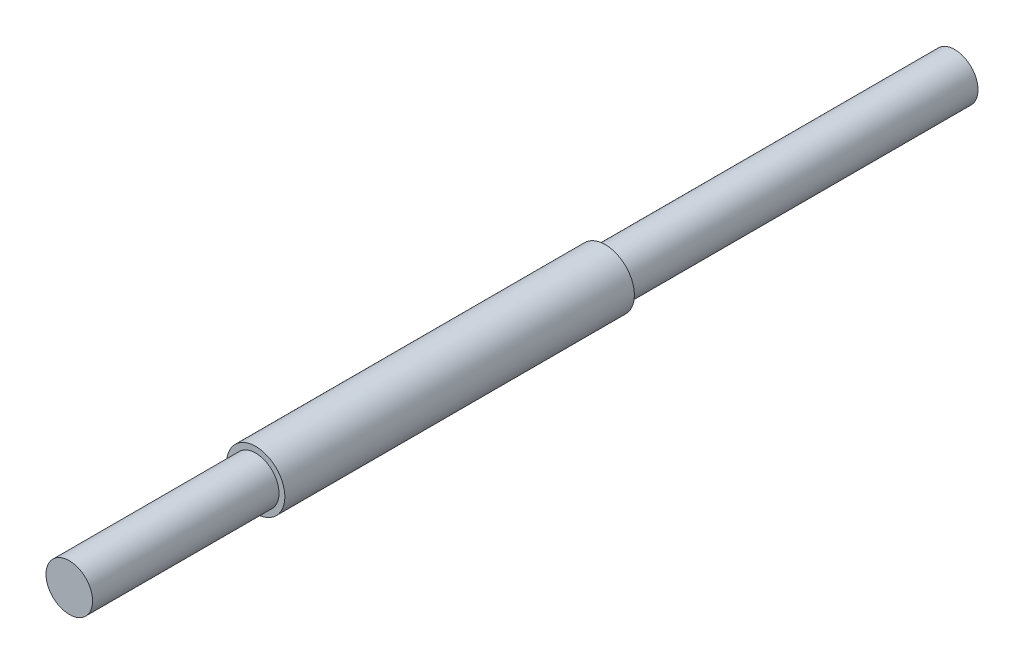
ISO-10303-21;
HEADER;
FILE_DESCRIPTION(('STEP AP214'),'2;1');
FILE_NAME('part.step','',(''),(''),'','','');
FILE_SCHEMA(('AUTOMOTIVE_DESIGN { 1 0 10303 214 1 1 1 1 }'));
ENDSEC;
DATA;
#1=APPLICATION_CONTEXT('core data for automotive mechanical design processes');
#2=APPLICATION_PROTOCOL_DEFINITION('international standard','automotive_design',2000,#1);
#3=PRODUCT_CONTEXT('',#1,'mechanical');
#4=PRODUCT('Part','Part','',(#3));
#5=PRODUCT_RELATED_PRODUCT_CATEGORY('part','',(#4));
#6=PRODUCT_DEFINITION_FORMATION('','',#4);
#7=PRODUCT_DEFINITION_CONTEXT('part definition',#1,'design');
#8=PRODUCT_DEFINITION('design','',#6,#7);
#9=PRODUCT_DEFINITION_SHAPE('','',#8);
#10=(LENGTH_UNIT() NAMED_UNIT(*) SI_UNIT(.MILLI.,.METRE.));
#11=(NAMED_UNIT(*) PLANE_ANGLE_UNIT() SI_UNIT($,.RADIAN.));
#12=(NAMED_UNIT(*) SI_UNIT($,.STERADIAN.) SOLID_ANGLE_UNIT());
#13=UNCERTAINTY_MEASURE_WITH_UNIT(LENGTH_MEASURE(1.E-05),#10,'distance_accuracy_value','');
#14=(GEOMETRIC_REPRESENTATION_CONTEXT(3) GLOBAL_UNCERTAINTY_ASSIGNED_CONTEXT((#13)) GLOBAL_UNIT_ASSIGNED_CONTEXT((#10,
#11,#12)) REPRESENTATION_CONTEXT('',''));
#15=CARTESIAN_POINT('',(0.,0.,0.));
#16=DIRECTION('',(0.,0.,1.));
#17=DIRECTION('',(1.,0.,0.));
#18=AXIS2_PLACEMENT_3D('',#15,#16,#17);
#19=CARTESIAN_POINT('',(0.,0.,-150.));
#20=DIRECTION('',(0.,0.,-1.));
#21=DIRECTION('',(-1.,0.,0.));
#22=AXIS2_PLACEMENT_3D('',#19,#20,#21);
#23=PLANE('',#22);
#24=CARTESIAN_POINT('',(0.,0.,-150.));
#25=DIRECTION('',(0.,0.,-1.));
#26=DIRECTION('',(-1.,0.,0.));
#27=AXIS2_PLACEMENT_3D('',#24,#25,#26);
#28=CIRCLE('',#27,12.5);
#29=CARTESIAN_POINT('',(-12.5,0.,-150.));
#30=VERTEX_POINT('',#29);
#31=EDGE_CURVE('E42',#30,#30,#28,.T.);
#32=ORIENTED_EDGE('',*,*,#31,.T.);
#33=EDGE_LOOP('',(#32));
#34=FACE_BOUND('',#33,.T.);
#35=CARTESIAN_POINT('',(0.,0.,-150.));
#36=DIRECTION('',(0.,0.,-1.));
#37=DIRECTION('',(-1.,0.,0.));
#38=AXIS2_PLACEMENT_3D('',#35,#36,#37);
#39=CIRCLE('',#38,10.);
#40=CARTESIAN_POINT('',(-10.,0.,-150.));
#41=VERTEX_POINT('',#40);
#42=EDGE_CURVE('E52',#41,#41,#39,.T.);
#43=ORIENTED_EDGE('',*,*,#42,.F.);
#44=EDGE_LOOP('',(#43));
#45=FACE_BOUND('',#44,.T.);
#46=ADVANCED_FACE('F31',(#34,#45),#23,.T.);
#47=CARTESIAN_POINT('',(0.,0.,80.));
#48=DIRECTION('',(0.,0.,-1.));
#49=DIRECTION('',(-1.,0.,0.));
#50=AXIS2_PLACEMENT_3D('',#47,#48,#49);
#51=CYLINDRICAL_SURFACE('',#50,10.);
#52=CARTESIAN_POINT('',(0.,0.,80.));
#53=DIRECTION('',(0.,0.,1.));
#54=DIRECTION('',(1.,0.,0.));
#55=AXIS2_PLACEMENT_3D('',#52,#53,#54);
#56=CIRCLE('',#55,10.);
#57=CARTESIAN_POINT('',(10.,0.,80.));
#58=VERTEX_POINT('',#57);
#59=EDGE_CURVE('E10',#58,#58,#56,.T.);
#60=ORIENTED_EDGE('',*,*,#59,.F.);
#61=EDGE_LOOP('',(#60));
#62=FACE_BOUND('',#61,.T.);
#63=CARTESIAN_POINT('',(0.,0.,0.));
#64=DIRECTION('',(0.,0.,-1.));
#65=DIRECTION('',(-1.,0.,0.));
#66=AXIS2_PLACEMENT_3D('',#63,#64,#65);
#67=CIRCLE('',#66,10.);
#68=CARTESIAN_POINT('',(-10.,0.,0.));
#69=VERTEX_POINT('',#68);
#70=EDGE_CURVE('E38',#69,#69,#67,.T.);
#71=ORIENTED_EDGE('',*,*,#70,.F.);
#72=EDGE_LOOP('',(#71));
#73=FACE_BOUND('',#72,.T.);
#74=ADVANCED_FACE('F33',(#62,#73),#51,.T.);
#75=CARTESIAN_POINT('',(0.,0.,80.));
#76=DIRECTION('',(0.,0.,1.));
#77=DIRECTION('',(1.,0.,0.));
#78=AXIS2_PLACEMENT_3D('',#75,#76,#77);
#79=PLANE('',#78);
#80=ORIENTED_EDGE('',*,*,#59,.T.);
#81=EDGE_LOOP('',(#80));
#82=FACE_BOUND('',#81,.T.);
#83=ADVANCED_FACE('F73',(#82),#79,.T.);
#84=CARTESIAN_POINT('',(0.,0.,0.));
#85=DIRECTION('',(0.,0.,-1.));
#86=DIRECTION('',(-1.,0.,0.));
#87=AXIS2_PLACEMENT_3D('',#84,#85,#86);
#88=PLANE('',#87);
#89=CARTESIAN_POINT('',(0.,0.,0.));
#90=DIRECTION('',(0.,0.,-1.));
#91=DIRECTION('',(-1.,0.,0.));
#92=AXIS2_PLACEMENT_3D('',#89,#90,#91);
#93=CIRCLE('',#92,12.5);
#94=CARTESIAN_POINT('',(-12.5,0.,0.));
#95=VERTEX_POINT('',#94);
#96=EDGE_CURVE('E46',#95,#95,#93,.T.);
#97=ORIENTED_EDGE('',*,*,#96,.F.);
#98=EDGE_LOOP('',(#97));
#99=FACE_BOUND('',#98,.T.);
#100=ORIENTED_EDGE('',*,*,#70,.T.);
#101=EDGE_LOOP('',(#100));
#102=FACE_BOUND('',#101,.T.);
#103=ADVANCED_FACE('F77',(#99,#102),#88,.F.);
#104=CARTESIAN_POINT('',(0.,0.,-150.));
#105=DIRECTION('',(0.,0.,1.));
#106=DIRECTION('',(1.,0.,0.));
#107=AXIS2_PLACEMENT_3D('',#104,#105,#106);
#108=CYLINDRICAL_SURFACE('',#107,12.5);
#109=ORIENTED_EDGE('',*,*,#31,.F.);
#110=EDGE_LOOP('',(#109));
#111=FACE_BOUND('',#110,.T.);
#112=ORIENTED_EDGE('',*,*,#96,.T.);
#113=EDGE_LOOP('',(#112));
#114=FACE_BOUND('',#113,.T.);
#115=ADVANCED_FACE('F63',(#111,#114),#108,.T.);
#116=CARTESIAN_POINT('',(0.,0.,-300.));
#117=DIRECTION('',(0.,0.,1.));
#118=DIRECTION('',(1.,0.,0.));
#119=AXIS2_PLACEMENT_3D('',#116,#117,#118);
#120=CYLINDRICAL_SURFACE('',#119,10.);
#121=CARTESIAN_POINT('',(0.,0.,-300.));
#122=DIRECTION('',(0.,0.,-1.));
#123=DIRECTION('',(-1.,0.,0.));
#124=AXIS2_PLACEMENT_3D('',#121,#122,#123);
#125=CIRCLE('',#124,10.);
#126=CARTESIAN_POINT('',(-10.,0.,-300.));
#127=VERTEX_POINT('',#126);
#128=EDGE_CURVE('E50',#127,#127,#125,.T.);
#129=ORIENTED_EDGE('',*,*,#128,.F.);
#130=EDGE_LOOP('',(#129));
#131=FACE_BOUND('',#130,.T.);
#132=ORIENTED_EDGE('',*,*,#42,.T.);
#133=EDGE_LOOP('',(#132));
#134=FACE_BOUND('',#133,.T.);
#135=ADVANCED_FACE('F60',(#131,#134),#120,.T.);
#136=CARTESIAN_POINT('',(0.,0.,-300.));
#137=DIRECTION('',(0.,0.,-1.));
#138=DIRECTION('',(-1.,0.,0.));
#139=AXIS2_PLACEMENT_3D('',#136,#137,#138);
#140=PLANE('',#139);
#141=ORIENTED_EDGE('',*,*,#128,.T.);
#142=EDGE_LOOP('',(#141));
#143=FACE_BOUND('',#142,.T.);
#144=ADVANCED_FACE('F58',(#143),#140,.T.);
#145=CLOSED_SHELL('',(#46,#74,#83,#103,#115,#135,#144));
#146=MANIFOLD_SOLID_BREP('B2',#145);
#147=ADVANCED_BREP_SHAPE_REPRESENTATION('',(#18,#146),#14);
#148=SHAPE_DEFINITION_REPRESENTATION(#9,#147);
ENDSEC;
END-ISO-10303-21;
